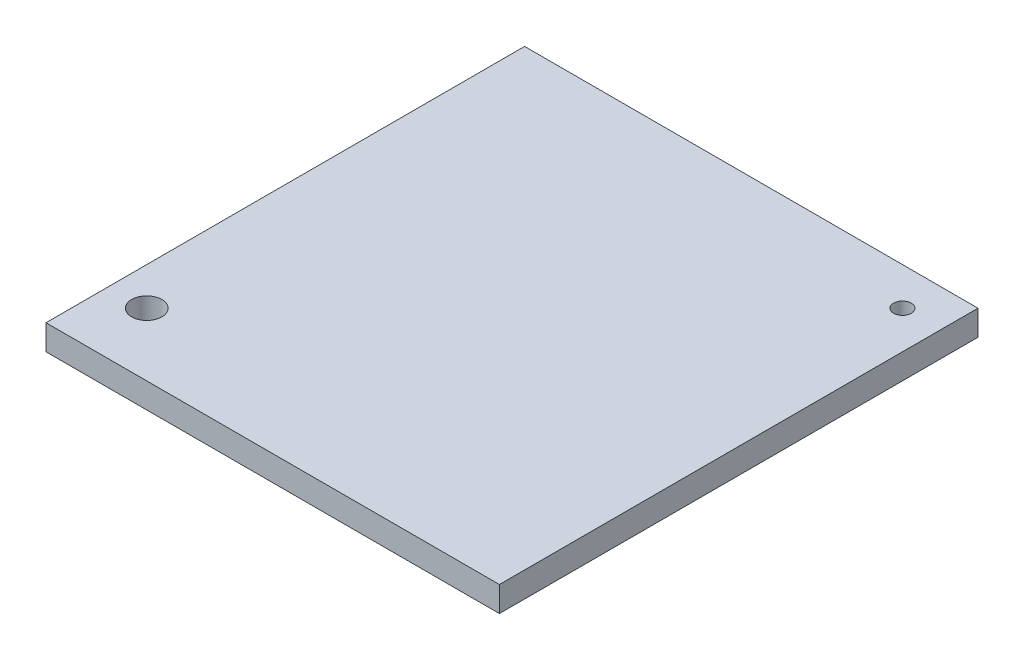
ISO-10303-21;
HEADER;
FILE_DESCRIPTION(('STEP AP214'),'2;1');
FILE_NAME('part.step','',(''),(''),'','','');
FILE_SCHEMA(('AUTOMOTIVE_DESIGN { 1 0 10303 214 1 1 1 1 }'));
ENDSEC;
DATA;
#1=APPLICATION_CONTEXT('core data for automotive mechanical design processes');
#2=APPLICATION_PROTOCOL_DEFINITION('international standard','automotive_design',2000,#1);
#3=PRODUCT_CONTEXT('',#1,'mechanical');
#4=PRODUCT('Part','Part','',(#3));
#5=PRODUCT_RELATED_PRODUCT_CATEGORY('part','',(#4));
#6=PRODUCT_DEFINITION_FORMATION('','',#4);
#7=PRODUCT_DEFINITION_CONTEXT('part definition',#1,'design');
#8=PRODUCT_DEFINITION('design','',#6,#7);
#9=PRODUCT_DEFINITION_SHAPE('','',#8);
#10=(LENGTH_UNIT() NAMED_UNIT(*) SI_UNIT(.MILLI.,.METRE.));
#11=(NAMED_UNIT(*) PLANE_ANGLE_UNIT() SI_UNIT($,.RADIAN.));
#12=(NAMED_UNIT(*) SI_UNIT($,.STERADIAN.) SOLID_ANGLE_UNIT());
#13=UNCERTAINTY_MEASURE_WITH_UNIT(LENGTH_MEASURE(1.E-05),#10,'distance_accuracy_value','');
#14=(GEOMETRIC_REPRESENTATION_CONTEXT(3) GLOBAL_UNCERTAINTY_ASSIGNED_CONTEXT((#13)) GLOBAL_UNIT_ASSIGNED_CONTEXT((#10,
#11,#12)) REPRESENTATION_CONTEXT('',''));
#15=CARTESIAN_POINT('',(0.,0.,0.));
#16=DIRECTION('',(0.,0.,1.));
#17=DIRECTION('',(1.,0.,0.));
#18=AXIS2_PLACEMENT_3D('',#15,#16,#17);
#19=CARTESIAN_POINT('',(-90.,10.,-90.));
#20=DIRECTION('',(1.,0.,0.));
#21=DIRECTION('',(0.,0.,-1.));
#22=AXIS2_PLACEMENT_3D('',#19,#20,#21);
#23=PLANE('',#22);
#24=DIRECTION('',(0.,0.,1.));
#25=VECTOR('',#24,1.);
#26=CARTESIAN_POINT('',(-90.,0.,-90.));
#27=LINE('',#26,#25);
#28=CARTESIAN_POINT('',(-90.,0.,-90.));
#29=VERTEX_POINT('',#28);
#30=CARTESIAN_POINT('',(-90.,0.,100.));
#31=VERTEX_POINT('',#30);
#32=EDGE_CURVE('E119',#29,#31,#27,.T.);
#33=ORIENTED_EDGE('',*,*,#32,.T.);
#34=DIRECTION('',(0.,-1.,0.));
#35=VECTOR('',#34,1.);
#36=CARTESIAN_POINT('',(-90.,10.,100.));
#37=LINE('',#36,#35);
#38=CARTESIAN_POINT('',(-90.,10.,100.));
#39=VERTEX_POINT('',#38);
#40=EDGE_CURVE('E11',#39,#31,#37,.T.);
#41=ORIENTED_EDGE('',*,*,#40,.F.);
#42=DIRECTION('',(0.,0.,1.));
#43=VECTOR('',#42,1.);
#44=CARTESIAN_POINT('',(-90.,10.,-90.));
#45=LINE('',#44,#43);
#46=CARTESIAN_POINT('',(-90.,10.,-90.));
#47=VERTEX_POINT('',#46);
#48=EDGE_CURVE('E103',#47,#39,#45,.T.);
#49=ORIENTED_EDGE('',*,*,#48,.F.);
#50=DIRECTION('',(0.,-1.,0.));
#51=VECTOR('',#50,1.);
#52=CARTESIAN_POINT('',(-90.,10.,-90.));
#53=LINE('',#52,#51);
#54=EDGE_CURVE('E115',#47,#29,#53,.T.);
#55=ORIENTED_EDGE('',*,*,#54,.T.);
#56=EDGE_LOOP('',(#33,#41,#49,#55));
#57=FACE_BOUND('',#56,.T.);
#58=ADVANCED_FACE('F51',(#57),#23,.F.);
#59=CARTESIAN_POINT('',(-90.,10.,100.));
#60=DIRECTION('',(0.,0.,-1.));
#61=DIRECTION('',(-1.,0.,0.));
#62=AXIS2_PLACEMENT_3D('',#59,#60,#61);
#63=PLANE('',#62);
#64=DIRECTION('',(1.,0.,0.));
#65=VECTOR('',#64,1.);
#66=CARTESIAN_POINT('',(-90.,0.,100.));
#67=LINE('',#66,#65);
#68=CARTESIAN_POINT('',(90.,0.,100.));
#69=VERTEX_POINT('',#68);
#70=EDGE_CURVE('E108',#31,#69,#67,.T.);
#71=ORIENTED_EDGE('',*,*,#70,.T.);
#72=DIRECTION('',(0.,-1.,0.));
#73=VECTOR('',#72,1.);
#74=CARTESIAN_POINT('',(90.,10.,100.));
#75=LINE('',#74,#73);
#76=CARTESIAN_POINT('',(90.,10.,100.));
#77=VERTEX_POINT('',#76);
#78=EDGE_CURVE('E60',#77,#69,#75,.T.);
#79=ORIENTED_EDGE('',*,*,#78,.F.);
#80=DIRECTION('',(1.,0.,0.));
#81=VECTOR('',#80,1.);
#82=CARTESIAN_POINT('',(-90.,10.,100.));
#83=LINE('',#82,#81);
#84=EDGE_CURVE('E98',#39,#77,#83,.T.);
#85=ORIENTED_EDGE('',*,*,#84,.F.);
#86=ORIENTED_EDGE('',*,*,#40,.T.);
#87=EDGE_LOOP('',(#71,#79,#85,#86));
#88=FACE_BOUND('',#87,.T.);
#89=ADVANCED_FACE('F107',(#88),#63,.F.);
#90=CARTESIAN_POINT('',(90.,10.,-90.));
#91=DIRECTION('',(-1.,0.,0.));
#92=DIRECTION('',(0.,0.,1.));
#93=AXIS2_PLACEMENT_3D('',#90,#91,#92);
#94=PLANE('',#93);
#95=DIRECTION('',(0.,0.,-1.));
#96=VECTOR('',#95,1.);
#97=CARTESIAN_POINT('',(90.,0.,-90.));
#98=LINE('',#97,#96);
#99=CARTESIAN_POINT('',(90.,0.,-90.));
#100=VERTEX_POINT('',#99);
#101=EDGE_CURVE('E85',#69,#100,#98,.T.);
#102=ORIENTED_EDGE('',*,*,#101,.T.);
#103=DIRECTION('',(0.,-1.,0.));
#104=VECTOR('',#103,1.);
#105=CARTESIAN_POINT('',(90.,10.,-90.));
#106=LINE('',#105,#104);
#107=CARTESIAN_POINT('',(90.,10.,-90.));
#108=VERTEX_POINT('',#107);
#109=EDGE_CURVE('E110',#108,#100,#106,.T.);
#110=ORIENTED_EDGE('',*,*,#109,.F.);
#111=DIRECTION('',(0.,0.,-1.));
#112=VECTOR('',#111,1.);
#113=CARTESIAN_POINT('',(90.,10.,-90.));
#114=LINE('',#113,#112);
#115=EDGE_CURVE('E101',#77,#108,#114,.T.);
#116=ORIENTED_EDGE('',*,*,#115,.F.);
#117=ORIENTED_EDGE('',*,*,#78,.T.);
#118=EDGE_LOOP('',(#102,#110,#116,#117));
#119=FACE_BOUND('',#118,.T.);
#120=ADVANCED_FACE('F111',(#119),#94,.F.);
#121=CARTESIAN_POINT('',(-90.,10.,-90.));
#122=DIRECTION('',(0.,0.,1.));
#123=DIRECTION('',(1.,0.,0.));
#124=AXIS2_PLACEMENT_3D('',#121,#122,#123);
#125=PLANE('',#124);
#126=DIRECTION('',(-1.,0.,0.));
#127=VECTOR('',#126,1.);
#128=CARTESIAN_POINT('',(-90.,0.,-90.));
#129=LINE('',#128,#127);
#130=EDGE_CURVE('E91',#100,#29,#129,.T.);
#131=ORIENTED_EDGE('',*,*,#130,.T.);
#132=ORIENTED_EDGE('',*,*,#54,.F.);
#133=DIRECTION('',(-1.,0.,0.));
#134=VECTOR('',#133,1.);
#135=CARTESIAN_POINT('',(-90.,10.,-90.));
#136=LINE('',#135,#134);
#137=EDGE_CURVE('E68',#108,#47,#136,.T.);
#138=ORIENTED_EDGE('',*,*,#137,.F.);
#139=ORIENTED_EDGE('',*,*,#109,.T.);
#140=EDGE_LOOP('',(#131,#132,#138,#139));
#141=FACE_BOUND('',#140,.T.);
#142=ADVANCED_FACE('F133',(#141),#125,.F.);
#143=CARTESIAN_POINT('',(0.,10.,0.));
#144=DIRECTION('',(0.,1.,0.));
#145=DIRECTION('',(0.,0.,1.));
#146=AXIS2_PLACEMENT_3D('',#143,#144,#145);
#147=PLANE('',#146);
#148=CARTESIAN_POINT('',(-75.,10.,75.));
#149=DIRECTION('',(0.,1.,0.));
#150=DIRECTION('',(0.,0.,1.));
#151=AXIS2_PLACEMENT_3D('',#148,#149,#150);
#152=CIRCLE('',#151,6.);
#153=CARTESIAN_POINT('',(-75.,10.,81.));
#154=VERTEX_POINT('',#153);
#155=EDGE_CURVE('E148',#154,#154,#152,.T.);
#156=ORIENTED_EDGE('',*,*,#155,.F.);
#157=EDGE_LOOP('',(#156));
#158=FACE_BOUND('',#157,.T.);
#159=CARTESIAN_POINT('',(75.,10.,-75.));
#160=DIRECTION('',(0.,1.,0.));
#161=DIRECTION('',(0.,0.,1.));
#162=AXIS2_PLACEMENT_3D('',#159,#160,#161);
#163=CIRCLE('',#162,3.50000000000001);
#164=CARTESIAN_POINT('',(75.,10.,-71.5));
#165=VERTEX_POINT('',#164);
#166=EDGE_CURVE('E140',#165,#165,#163,.T.);
#167=ORIENTED_EDGE('',*,*,#166,.F.);
#168=EDGE_LOOP('',(#167));
#169=FACE_BOUND('',#168,.T.);
#170=ORIENTED_EDGE('',*,*,#48,.T.);
#171=ORIENTED_EDGE('',*,*,#84,.T.);
#172=ORIENTED_EDGE('',*,*,#115,.T.);
#173=ORIENTED_EDGE('',*,*,#137,.T.);
#174=EDGE_LOOP('',(#170,#171,#172,#173));
#175=FACE_BOUND('',#174,.T.);
#176=ADVANCED_FACE('F99',(#158,#169,#175),#147,.T.);
#177=CARTESIAN_POINT('',(0.,0.,0.));
#178=DIRECTION('',(0.,1.,0.));
#179=DIRECTION('',(0.,0.,1.));
#180=AXIS2_PLACEMENT_3D('',#177,#178,#179);
#181=PLANE('',#180);
#182=CARTESIAN_POINT('',(-75.,0.,75.));
#183=DIRECTION('',(0.,1.,0.));
#184=DIRECTION('',(0.,0.,1.));
#185=AXIS2_PLACEMENT_3D('',#182,#183,#184);
#186=CIRCLE('',#185,6.);
#187=CARTESIAN_POINT('',(-75.,0.,81.));
#188=VERTEX_POINT('',#187);
#189=EDGE_CURVE('E144',#188,#188,#186,.T.);
#190=ORIENTED_EDGE('',*,*,#189,.T.);
#191=EDGE_LOOP('',(#190));
#192=FACE_BOUND('',#191,.T.);
#193=CARTESIAN_POINT('',(75.,0.,-75.));
#194=DIRECTION('',(0.,1.,0.));
#195=DIRECTION('',(0.,0.,1.));
#196=AXIS2_PLACEMENT_3D('',#193,#194,#195);
#197=CIRCLE('',#196,3.50000000000001);
#198=CARTESIAN_POINT('',(75.,0.,-71.5));
#199=VERTEX_POINT('',#198);
#200=EDGE_CURVE('E123',#199,#199,#197,.T.);
#201=ORIENTED_EDGE('',*,*,#200,.T.);
#202=EDGE_LOOP('',(#201));
#203=FACE_BOUND('',#202,.T.);
#204=ORIENTED_EDGE('',*,*,#32,.F.);
#205=ORIENTED_EDGE('',*,*,#130,.F.);
#206=ORIENTED_EDGE('',*,*,#101,.F.);
#207=ORIENTED_EDGE('',*,*,#70,.F.);
#208=EDGE_LOOP('',(#204,#205,#206,#207));
#209=FACE_BOUND('',#208,.T.);
#210=ADVANCED_FACE('F136',(#192,#203,#209),#181,.F.);
#211=CARTESIAN_POINT('',(75.,0.,-75.));
#212=DIRECTION('',(0.,1.,0.));
#213=DIRECTION('',(0.,0.,1.));
#214=AXIS2_PLACEMENT_3D('',#211,#212,#213);
#215=CYLINDRICAL_SURFACE('',#214,3.50000000000001);
#216=ORIENTED_EDGE('',*,*,#200,.F.);
#217=EDGE_LOOP('',(#216));
#218=FACE_BOUND('',#217,.T.);
#219=ORIENTED_EDGE('',*,*,#166,.T.);
#220=EDGE_LOOP('',(#219));
#221=FACE_BOUND('',#220,.T.);
#222=ADVANCED_FACE('F161',(#218,#221),#215,.F.);
#223=CARTESIAN_POINT('',(-75.,0.,75.));
#224=DIRECTION('',(0.,1.,0.));
#225=DIRECTION('',(0.,0.,1.));
#226=AXIS2_PLACEMENT_3D('',#223,#224,#225);
#227=CYLINDRICAL_SURFACE('',#226,6.);
#228=ORIENTED_EDGE('',*,*,#189,.F.);
#229=EDGE_LOOP('',(#228));
#230=FACE_BOUND('',#229,.T.);
#231=ORIENTED_EDGE('',*,*,#155,.T.);
#232=EDGE_LOOP('',(#231));
#233=FACE_BOUND('',#232,.T.);
#234=ADVANCED_FACE('F158',(#230,#233),#227,.F.);
#235=CLOSED_SHELL('',(#58,#89,#120,#142,#176,#210,#222,#234));
#236=MANIFOLD_SOLID_BREP('B2',#235);
#237=ADVANCED_BREP_SHAPE_REPRESENTATION('',(#18,#236),#14);
#238=SHAPE_DEFINITION_REPRESENTATION(#9,#237);
ENDSEC;
END-ISO-10303-21;
